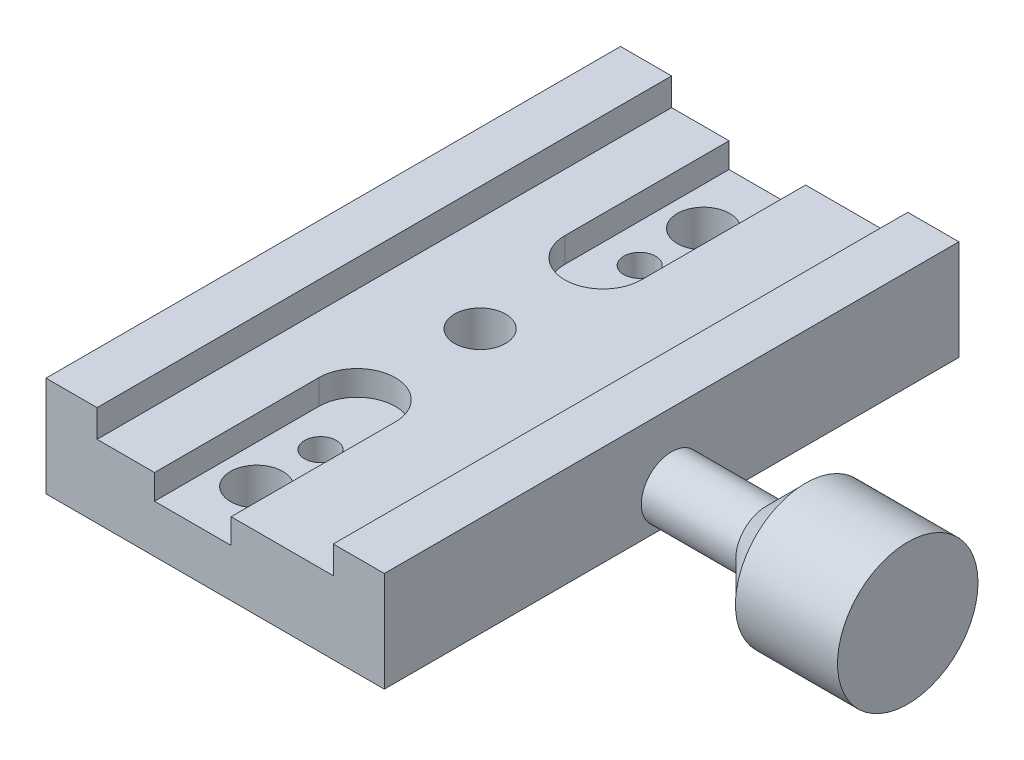
ISO-10303-21;
HEADER;
FILE_DESCRIPTION(('STEP AP214'),'2;1');
FILE_NAME('part.step','',(''),(''),'','','');
FILE_SCHEMA(('AUTOMOTIVE_DESIGN { 1 0 10303 214 1 1 1 1 }'));
ENDSEC;
DATA;
#1=APPLICATION_CONTEXT('core data for automotive mechanical design processes');
#2=APPLICATION_PROTOCOL_DEFINITION('international standard','automotive_design',2000,#1);
#3=PRODUCT_CONTEXT('',#1,'mechanical');
#4=PRODUCT('Part','Part','',(#3));
#5=PRODUCT_RELATED_PRODUCT_CATEGORY('part','',(#4));
#6=PRODUCT_DEFINITION_FORMATION('','',#4);
#7=PRODUCT_DEFINITION_CONTEXT('part definition',#1,'design');
#8=PRODUCT_DEFINITION('design','',#6,#7);
#9=PRODUCT_DEFINITION_SHAPE('','',#8);
#10=(LENGTH_UNIT() NAMED_UNIT(*) SI_UNIT(.MILLI.,.METRE.));
#11=(NAMED_UNIT(*) PLANE_ANGLE_UNIT() SI_UNIT($,.RADIAN.));
#12=(NAMED_UNIT(*) SI_UNIT($,.STERADIAN.) SOLID_ANGLE_UNIT());
#13=UNCERTAINTY_MEASURE_WITH_UNIT(LENGTH_MEASURE(1.E-05),#10,'distance_accuracy_value','');
#14=(GEOMETRIC_REPRESENTATION_CONTEXT(3) GLOBAL_UNCERTAINTY_ASSIGNED_CONTEXT((#13)) GLOBAL_UNIT_ASSIGNED_CONTEXT((#10,
#11,#12)) REPRESENTATION_CONTEXT('',''));
#15=CARTESIAN_POINT('',(0.,0.,0.));
#16=DIRECTION('',(0.,0.,1.));
#17=DIRECTION('',(1.,0.,0.));
#18=AXIS2_PLACEMENT_3D('',#15,#16,#17);
#19=CARTESIAN_POINT('',(0.,15.9715288495916,20.));
#20=DIRECTION('',(0.,-1.,0.));
#21=DIRECTION('',(0.,0.,-1.));
#22=AXIS2_PLACEMENT_3D('',#19,#20,#21);
#23=CYLINDRICAL_SURFACE('',#22,2.5);
#24=CARTESIAN_POINT('',(0.,0.,20.));
#25=DIRECTION('',(0.,1.,0.));
#26=DIRECTION('',(0.,0.,1.));
#27=AXIS2_PLACEMENT_3D('',#24,#25,#26);
#28=CIRCLE('',#27,2.5);
#29=CARTESIAN_POINT('',(0.,0.,22.5));
#30=VERTEX_POINT('',#29);
#31=EDGE_CURVE('E227',#30,#30,#28,.T.);
#32=ORIENTED_EDGE('',*,*,#31,.F.);
#33=EDGE_LOOP('',(#32));
#34=FACE_BOUND('',#33,.T.);
#35=CARTESIAN_POINT('',(0.,7.5,20.));
#36=DIRECTION('',(0.,1.,0.));
#37=DIRECTION('',(0.,0.,1.));
#38=AXIS2_PLACEMENT_3D('',#35,#36,#37);
#39=CIRCLE('',#38,2.5);
#40=CARTESIAN_POINT('',(0.,7.5,22.5));
#41=VERTEX_POINT('',#40);
#42=EDGE_CURVE('E220',#41,#41,#39,.T.);
#43=ORIENTED_EDGE('',*,*,#42,.T.);
#44=EDGE_LOOP('',(#43));
#45=FACE_BOUND('',#44,.T.);
#46=ADVANCED_FACE('F46',(#34,#45),#23,.F.);
#47=CARTESIAN_POINT('',(0.,15.9715288495916,9.99999999999999));
#48=DIRECTION('',(0.,-1.,0.));
#49=DIRECTION('',(0.,0.,-1.));
#50=AXIS2_PLACEMENT_3D('',#47,#48,#49);
#51=CYLINDRICAL_SURFACE('',#50,4.1);
#52=CARTESIAN_POINT('',(0.,0.,9.99999999999999));
#53=DIRECTION('',(0.,1.,0.));
#54=DIRECTION('',(0.,0.,1.));
#55=AXIS2_PLACEMENT_3D('',#52,#53,#54);
#56=CIRCLE('',#55,4.1);
#57=CARTESIAN_POINT('',(0.,0.,14.1));
#58=VERTEX_POINT('',#57);
#59=EDGE_CURVE('E231',#58,#58,#56,.T.);
#60=ORIENTED_EDGE('',*,*,#59,.F.);
#61=EDGE_LOOP('',(#60));
#62=FACE_BOUND('',#61,.T.);
#63=CARTESIAN_POINT('',(0.,7.5,9.99999999999999));
#64=DIRECTION('',(0.,1.,0.));
#65=DIRECTION('',(0.,0.,1.));
#66=AXIS2_PLACEMENT_3D('',#63,#64,#65);
#67=CIRCLE('',#66,4.1);
#68=CARTESIAN_POINT('',(0.,7.5,14.1));
#69=VERTEX_POINT('',#68);
#70=EDGE_CURVE('E219',#69,#69,#67,.T.);
#71=ORIENTED_EDGE('',*,*,#70,.T.);
#72=EDGE_LOOP('',(#71));
#73=FACE_BOUND('',#72,.T.);
#74=ADVANCED_FACE('F405',(#62,#73),#51,.F.);
#75=CARTESIAN_POINT('',(0.,15.9715288495916,70.));
#76=DIRECTION('',(0.,-1.,0.));
#77=DIRECTION('',(0.,0.,-1.));
#78=AXIS2_PLACEMENT_3D('',#75,#76,#77);
#79=CYLINDRICAL_SURFACE('',#78,2.5);
#80=CARTESIAN_POINT('',(0.,0.,70.));
#81=DIRECTION('',(0.,1.,0.));
#82=DIRECTION('',(0.,0.,-1.));
#83=AXIS2_PLACEMENT_3D('',#80,#81,#82);
#84=CIRCLE('',#83,2.5);
#85=CARTESIAN_POINT('',(0.,0.,67.5));
#86=VERTEX_POINT('',#85);
#87=EDGE_CURVE('E234',#86,#86,#84,.T.);
#88=ORIENTED_EDGE('',*,*,#87,.F.);
#89=EDGE_LOOP('',(#88));
#90=FACE_BOUND('',#89,.T.);
#91=CARTESIAN_POINT('',(0.,7.5,70.));
#92=DIRECTION('',(0.,1.,0.));
#93=DIRECTION('',(0.,0.,1.));
#94=AXIS2_PLACEMENT_3D('',#91,#92,#93);
#95=CIRCLE('',#94,2.5);
#96=CARTESIAN_POINT('',(0.,7.5,72.5));
#97=VERTEX_POINT('',#96);
#98=EDGE_CURVE('E214',#97,#97,#95,.T.);
#99=ORIENTED_EDGE('',*,*,#98,.T.);
#100=EDGE_LOOP('',(#99));
#101=FACE_BOUND('',#100,.T.);
#102=ADVANCED_FACE('F412',(#90,#101),#79,.F.);
#103=CARTESIAN_POINT('',(0.,15.9715288495916,80.));
#104=DIRECTION('',(0.,-1.,0.));
#105=DIRECTION('',(0.,0.,-1.));
#106=AXIS2_PLACEMENT_3D('',#103,#104,#105);
#107=CYLINDRICAL_SURFACE('',#106,4.1);
#108=CARTESIAN_POINT('',(0.,0.,80.));
#109=DIRECTION('',(0.,1.,0.));
#110=DIRECTION('',(0.,0.,-1.));
#111=AXIS2_PLACEMENT_3D('',#108,#109,#110);
#112=CIRCLE('',#111,4.1);
#113=CARTESIAN_POINT('',(0.,0.,75.9));
#114=VERTEX_POINT('',#113);
#115=EDGE_CURVE('E226',#114,#114,#112,.T.);
#116=ORIENTED_EDGE('',*,*,#115,.F.);
#117=EDGE_LOOP('',(#116));
#118=FACE_BOUND('',#117,.T.);
#119=CARTESIAN_POINT('',(0.,7.5,80.));
#120=DIRECTION('',(0.,1.,0.));
#121=DIRECTION('',(0.,0.,1.));
#122=AXIS2_PLACEMENT_3D('',#119,#120,#121);
#123=CIRCLE('',#122,4.1);
#124=CARTESIAN_POINT('',(0.,7.5,84.1));
#125=VERTEX_POINT('',#124);
#126=EDGE_CURVE('E190',#125,#125,#123,.T.);
#127=ORIENTED_EDGE('',*,*,#126,.T.);
#128=EDGE_LOOP('',(#127));
#129=FACE_BOUND('',#128,.T.);
#130=ADVANCED_FACE('F420',(#118,#129),#107,.F.);
#131=CARTESIAN_POINT('',(147.435028842544,4.97152884959158,45.));
#132=DIRECTION('',(-1.,0.,0.));
#133=DIRECTION('',(0.,0.,1.));
#134=AXIS2_PLACEMENT_3D('',#131,#132,#133);
#135=CYLINDRICAL_SURFACE('',#134,4.75);
#136=CARTESIAN_POINT('',(44.8000000000002,4.97152884959158,45.));
#137=DIRECTION('',(1.,0.,0.));
#138=DIRECTION('',(0.,0.,-1.));
#139=AXIS2_PLACEMENT_3D('',#136,#137,#138);
#140=CIRCLE('',#139,4.75);
#141=CARTESIAN_POINT('',(44.8000000000002,4.97152884959158,40.25));
#142=VERTEX_POINT('',#141);
#143=EDGE_CURVE('E322',#142,#142,#140,.F.);
#144=ORIENTED_EDGE('',*,*,#143,.T.);
#145=EDGE_LOOP('',(#144));
#146=FACE_BOUND('',#145,.T.);
#147=CARTESIAN_POINT('',(30.,4.97152884959158,45.));
#148=DIRECTION('',(-1.,0.,0.));
#149=DIRECTION('',(0.,0.,1.));
#150=AXIS2_PLACEMENT_3D('',#147,#148,#149);
#151=CIRCLE('',#150,4.75);
#152=CARTESIAN_POINT('',(30.,4.97152884959158,49.75));
#153=VERTEX_POINT('',#152);
#154=EDGE_CURVE('E316',#153,#153,#151,.F.);
#155=ORIENTED_EDGE('',*,*,#154,.T.);
#156=EDGE_LOOP('',(#155));
#157=FACE_BOUND('',#156,.T.);
#158=ADVANCED_FACE('F424',(#146,#157),#135,.T.);
#159=CARTESIAN_POINT('',(0.,0.,90.));
#160=DIRECTION('',(0.,1.,0.));
#161=DIRECTION('',(0.,0.,1.));
#162=AXIS2_PLACEMENT_3D('',#159,#160,#161);
#163=PLANE('',#162);
#164=ORIENTED_EDGE('',*,*,#115,.T.);
#165=EDGE_LOOP('',(#164));
#166=FACE_BOUND('',#165,.T.);
#167=ORIENTED_EDGE('',*,*,#87,.T.);
#168=EDGE_LOOP('',(#167));
#169=FACE_BOUND('',#168,.T.);
#170=ORIENTED_EDGE('',*,*,#59,.T.);
#171=EDGE_LOOP('',(#170));
#172=FACE_BOUND('',#171,.T.);
#173=ORIENTED_EDGE('',*,*,#31,.T.);
#174=EDGE_LOOP('',(#173));
#175=FACE_BOUND('',#174,.T.);
#176=CARTESIAN_POINT('',(0.,0.,45.));
#177=DIRECTION('',(0.,1.,0.));
#178=DIRECTION('',(0.,0.,1.));
#179=AXIS2_PLACEMENT_3D('',#176,#177,#178);
#180=CIRCLE('',#179,4.);
#181=CARTESIAN_POINT('',(0.,0.,49.));
#182=VERTEX_POINT('',#181);
#183=EDGE_CURVE('E230',#182,#182,#180,.T.);
#184=ORIENTED_EDGE('',*,*,#183,.T.);
#185=EDGE_LOOP('',(#184));
#186=FACE_BOUND('',#185,.T.);
#187=DIRECTION('',(1.,0.,0.));
#188=VECTOR('',#187,1.);
#189=CARTESIAN_POINT('',(0.,0.,0.));
#190=LINE('',#189,#188);
#191=CARTESIAN_POINT('',(-23.,0.,0.));
#192=VERTEX_POINT('',#191);
#193=CARTESIAN_POINT('',(30.,0.,0.));
#194=VERTEX_POINT('',#193);
#195=EDGE_CURVE('E245',#192,#194,#190,.T.);
#196=ORIENTED_EDGE('',*,*,#195,.T.);
#197=DIRECTION('',(0.,0.,-1.));
#198=VECTOR('',#197,1.);
#199=CARTESIAN_POINT('',(30.,0.,90.));
#200=LINE('',#199,#198);
#201=CARTESIAN_POINT('',(30.,0.,90.));
#202=VERTEX_POINT('',#201);
#203=EDGE_CURVE('E312',#202,#194,#200,.T.);
#204=ORIENTED_EDGE('',*,*,#203,.F.);
#205=DIRECTION('',(1.,0.,0.));
#206=VECTOR('',#205,1.);
#207=CARTESIAN_POINT('',(0.,0.,90.));
#208=LINE('',#207,#206);
#209=CARTESIAN_POINT('',(-23.,0.,90.));
#210=VERTEX_POINT('',#209);
#211=EDGE_CURVE('E249',#210,#202,#208,.T.);
#212=ORIENTED_EDGE('',*,*,#211,.F.);
#213=DIRECTION('',(0.,0.,-1.));
#214=VECTOR('',#213,1.);
#215=CARTESIAN_POINT('',(-23.,0.,90.));
#216=LINE('',#215,#214);
#217=EDGE_CURVE('E268',#210,#192,#216,.T.);
#218=ORIENTED_EDGE('',*,*,#217,.T.);
#219=EDGE_LOOP('',(#196,#204,#212,#218));
#220=FACE_BOUND('',#219,.T.);
#221=ADVANCED_FACE('F364',(#166,#169,#172,#175,#186,#220),#163,.F.);
#222=CARTESIAN_POINT('',(30.,0.,90.));
#223=DIRECTION('',(-1.,0.,0.));
#224=DIRECTION('',(0.,0.,1.));
#225=AXIS2_PLACEMENT_3D('',#222,#223,#224);
#226=PLANE('',#225);
#227=ORIENTED_EDGE('',*,*,#154,.F.);
#228=EDGE_LOOP('',(#227));
#229=FACE_BOUND('',#228,.T.);
#230=DIRECTION('',(0.,1.,0.));
#231=VECTOR('',#230,1.);
#232=CARTESIAN_POINT('',(30.,0.,0.));
#233=LINE('',#232,#231);
#234=CARTESIAN_POINT('',(30.,15.7,0.));
#235=VERTEX_POINT('',#234);
#236=EDGE_CURVE('E270',#194,#235,#233,.T.);
#237=ORIENTED_EDGE('',*,*,#236,.T.);
#238=DIRECTION('',(0.,0.,-1.));
#239=VECTOR('',#238,1.);
#240=CARTESIAN_POINT('',(30.,15.7,90.));
#241=LINE('',#240,#239);
#242=CARTESIAN_POINT('',(30.,15.7,90.));
#243=VERTEX_POINT('',#242);
#244=EDGE_CURVE('E308',#243,#235,#241,.T.);
#245=ORIENTED_EDGE('',*,*,#244,.F.);
#246=DIRECTION('',(0.,1.,0.));
#247=VECTOR('',#246,1.);
#248=CARTESIAN_POINT('',(30.,0.,90.));
#249=LINE('',#248,#247);
#250=EDGE_CURVE('E251',#202,#243,#249,.T.);
#251=ORIENTED_EDGE('',*,*,#250,.F.);
#252=ORIENTED_EDGE('',*,*,#203,.T.);
#253=EDGE_LOOP('',(#237,#245,#251,#252));
#254=FACE_BOUND('',#253,.T.);
#255=ADVANCED_FACE('F370',(#229,#254),#226,.F.);
#256=CARTESIAN_POINT('',(30.,15.7,90.));
#257=DIRECTION('',(0.,-1.,0.));
#258=DIRECTION('',(0.,0.,-1.));
#259=AXIS2_PLACEMENT_3D('',#256,#257,#258);
#260=PLANE('',#259);
#261=DIRECTION('',(-1.,0.,0.));
#262=VECTOR('',#261,1.);
#263=CARTESIAN_POINT('',(30.,15.7,0.));
#264=LINE('',#263,#262);
#265=CARTESIAN_POINT('',(22.,15.7,0.));
#266=VERTEX_POINT('',#265);
#267=EDGE_CURVE('E272',#235,#266,#264,.T.);
#268=ORIENTED_EDGE('',*,*,#267,.T.);
#269=DIRECTION('',(0.,0.,-1.));
#270=VECTOR('',#269,1.);
#271=CARTESIAN_POINT('',(22.,15.7,90.));
#272=LINE('',#271,#270);
#273=CARTESIAN_POINT('',(22.,15.7,90.));
#274=VERTEX_POINT('',#273);
#275=EDGE_CURVE('E304',#274,#266,#272,.T.);
#276=ORIENTED_EDGE('',*,*,#275,.F.);
#277=DIRECTION('',(-1.,0.,0.));
#278=VECTOR('',#277,1.);
#279=CARTESIAN_POINT('',(30.,15.7,90.));
#280=LINE('',#279,#278);
#281=EDGE_CURVE('E254',#243,#274,#280,.T.);
#282=ORIENTED_EDGE('',*,*,#281,.F.);
#283=ORIENTED_EDGE('',*,*,#244,.T.);
#284=EDGE_LOOP('',(#268,#276,#282,#283));
#285=FACE_BOUND('',#284,.T.);
#286=ADVANCED_FACE('F374',(#285),#260,.F.);
#287=CARTESIAN_POINT('',(22.,15.7,90.));
#288=DIRECTION('',(1.,0.,0.));
#289=DIRECTION('',(0.,0.,-1.));
#290=AXIS2_PLACEMENT_3D('',#287,#288,#289);
#291=PLANE('',#290);
#292=DIRECTION('',(0.,-1.,0.));
#293=VECTOR('',#292,1.);
#294=CARTESIAN_POINT('',(22.,15.7,0.));
#295=LINE('',#294,#293);
#296=CARTESIAN_POINT('',(22.,11.4,0.));
#297=VERTEX_POINT('',#296);
#298=EDGE_CURVE('E274',#266,#297,#295,.T.);
#299=ORIENTED_EDGE('',*,*,#298,.T.);
#300=DIRECTION('',(0.,0.,-1.));
#301=VECTOR('',#300,1.);
#302=CARTESIAN_POINT('',(22.,11.4,90.));
#303=LINE('',#302,#301);
#304=CARTESIAN_POINT('',(22.,11.4,90.));
#305=VERTEX_POINT('',#304);
#306=EDGE_CURVE('E301',#305,#297,#303,.T.);
#307=ORIENTED_EDGE('',*,*,#306,.F.);
#308=DIRECTION('',(0.,-1.,0.));
#309=VECTOR('',#308,1.);
#310=CARTESIAN_POINT('',(22.,15.7,90.));
#311=LINE('',#310,#309);
#312=EDGE_CURVE('E256',#274,#305,#311,.T.);
#313=ORIENTED_EDGE('',*,*,#312,.F.);
#314=ORIENTED_EDGE('',*,*,#275,.T.);
#315=EDGE_LOOP('',(#299,#307,#313,#314));
#316=FACE_BOUND('',#315,.T.);
#317=ADVANCED_FACE('F379',(#316),#291,.F.);
#318=CARTESIAN_POINT('',(-15.,11.4,90.));
#319=DIRECTION('',(0.,-1.,0.));
#320=DIRECTION('',(1.,0.,0.));
#321=AXIS2_PLACEMENT_3D('',#318,#319,#320);
#322=PLANE('',#321);
#323=CARTESIAN_POINT('',(0.,11.4,45.));
#324=DIRECTION('',(0.,-1.,0.));
#325=DIRECTION('',(1.,0.,0.));
#326=AXIS2_PLACEMENT_3D('',#323,#324,#325);
#327=CIRCLE('',#326,4.);
#328=CARTESIAN_POINT('',(4.00000000000001,11.4,45.));
#329=VERTEX_POINT('',#328);
#330=EDGE_CURVE('E241',#329,#329,#327,.F.);
#331=ORIENTED_EDGE('',*,*,#330,.F.);
#332=EDGE_LOOP('',(#331));
#333=FACE_BOUND('',#332,.T.);
#334=CARTESIAN_POINT('',(0.,11.4,25.7294246898479));
#335=DIRECTION('',(0.,1.,0.));
#336=DIRECTION('',(-1.,0.,0.));
#337=AXIS2_PLACEMENT_3D('',#334,#335,#336);
#338=CIRCLE('',#337,6.);
#339=CARTESIAN_POINT('',(-6.,11.4,25.7294246898479));
#340=VERTEX_POINT('',#339);
#341=CARTESIAN_POINT('',(6.,11.4,25.7294246898479));
#342=VERTEX_POINT('',#341);
#343=EDGE_CURVE('E171',#340,#342,#338,.T.);
#344=ORIENTED_EDGE('',*,*,#343,.F.);
#345=DIRECTION('',(0.,0.,1.));
#346=VECTOR('',#345,1.);
#347=CARTESIAN_POINT('',(-6.,11.4,25.7294246898479));
#348=LINE('',#347,#346);
#349=CARTESIAN_POINT('',(-6.,11.4,0.));
#350=VERTEX_POINT('',#349);
#351=EDGE_CURVE('E167',#350,#340,#348,.T.);
#352=ORIENTED_EDGE('',*,*,#351,.F.);
#353=DIRECTION('',(-1.,0.,0.));
#354=VECTOR('',#353,1.);
#355=CARTESIAN_POINT('',(-15.,11.4,0.));
#356=LINE('',#355,#354);
#357=CARTESIAN_POINT('',(-15.,11.4,0.));
#358=VERTEX_POINT('',#357);
#359=EDGE_CURVE('E277',#350,#358,#356,.T.);
#360=ORIENTED_EDGE('',*,*,#359,.T.);
#361=DIRECTION('',(0.,0.,-1.));
#362=VECTOR('',#361,1.);
#363=CARTESIAN_POINT('',(-15.,11.4,90.));
#364=LINE('',#363,#362);
#365=CARTESIAN_POINT('',(-15.,11.4,90.));
#366=VERTEX_POINT('',#365);
#367=EDGE_CURVE('E297',#366,#358,#364,.T.);
#368=ORIENTED_EDGE('',*,*,#367,.F.);
#369=DIRECTION('',(-1.,0.,0.));
#370=VECTOR('',#369,1.);
#371=CARTESIAN_POINT('',(22.,11.4,90.));
#372=LINE('',#371,#370);
#373=CARTESIAN_POINT('',(-6.,11.4,90.));
#374=VERTEX_POINT('',#373);
#375=EDGE_CURVE('E258',#374,#366,#372,.T.);
#376=ORIENTED_EDGE('',*,*,#375,.F.);
#377=DIRECTION('',(0.,0.,1.));
#378=VECTOR('',#377,1.);
#379=CARTESIAN_POINT('',(-6.,11.4,64.2705753101521));
#380=LINE('',#379,#378);
#381=CARTESIAN_POINT('',(-6.,11.4,64.2705753101521));
#382=VERTEX_POINT('',#381);
#383=EDGE_CURVE('E204',#382,#374,#380,.T.);
#384=ORIENTED_EDGE('',*,*,#383,.F.);
#385=CARTESIAN_POINT('',(0.,11.4,64.2705753101521));
#386=DIRECTION('',(0.,1.,0.));
#387=DIRECTION('',(1.,0.,0.));
#388=AXIS2_PLACEMENT_3D('',#385,#386,#387);
#389=CIRCLE('',#388,6.);
#390=CARTESIAN_POINT('',(6.,11.4,64.2705753101521));
#391=VERTEX_POINT('',#390);
#392=EDGE_CURVE('E176',#391,#382,#389,.T.);
#393=ORIENTED_EDGE('',*,*,#392,.F.);
#394=DIRECTION('',(0.,0.,-1.));
#395=VECTOR('',#394,1.);
#396=CARTESIAN_POINT('',(6.,11.4,64.2705753101521));
#397=LINE('',#396,#395);
#398=CARTESIAN_POINT('',(6.,11.4,90.));
#399=VERTEX_POINT('',#398);
#400=EDGE_CURVE('E197',#399,#391,#397,.T.);
#401=ORIENTED_EDGE('',*,*,#400,.F.);
#402=EDGE_CURVE('E259',#305,#399,#372,.T.);
#403=ORIENTED_EDGE('',*,*,#402,.F.);
#404=ORIENTED_EDGE('',*,*,#306,.T.);
#405=CARTESIAN_POINT('',(6.,11.4,0.));
#406=VERTEX_POINT('',#405);
#407=EDGE_CURVE('E181',#297,#406,#356,.T.);
#408=ORIENTED_EDGE('',*,*,#407,.T.);
#409=DIRECTION('',(0.,0.,-1.));
#410=VECTOR('',#409,1.);
#411=CARTESIAN_POINT('',(6.,11.4,25.7294246898479));
#412=LINE('',#411,#410);
#413=EDGE_CURVE('E163',#342,#406,#412,.T.);
#414=ORIENTED_EDGE('',*,*,#413,.F.);
#415=EDGE_LOOP('',(#344,#352,#360,#368,#376,#384,#393,#401,#403,#404,#408,#414));
#416=FACE_BOUND('',#415,.T.);
#417=ADVANCED_FACE('F179',(#333,#416),#322,.F.);
#418=CARTESIAN_POINT('',(-15.,15.7,90.));
#419=DIRECTION('',(-1.,0.,0.));
#420=DIRECTION('',(0.,-1.,0.));
#421=AXIS2_PLACEMENT_3D('',#418,#419,#420);
#422=PLANE('',#421);
#423=DIRECTION('',(0.,1.,0.));
#424=VECTOR('',#423,1.);
#425=CARTESIAN_POINT('',(-15.,15.7,0.));
#426=LINE('',#425,#424);
#427=CARTESIAN_POINT('',(-15.,15.7,0.));
#428=VERTEX_POINT('',#427);
#429=EDGE_CURVE('E280',#358,#428,#426,.T.);
#430=ORIENTED_EDGE('',*,*,#429,.T.);
#431=DIRECTION('',(0.,0.,-1.));
#432=VECTOR('',#431,1.);
#433=CARTESIAN_POINT('',(-15.,15.7,90.));
#434=LINE('',#433,#432);
#435=CARTESIAN_POINT('',(-15.,15.7,90.));
#436=VERTEX_POINT('',#435);
#437=EDGE_CURVE('E293',#436,#428,#434,.T.);
#438=ORIENTED_EDGE('',*,*,#437,.F.);
#439=DIRECTION('',(0.,1.,0.));
#440=VECTOR('',#439,1.);
#441=CARTESIAN_POINT('',(-15.,15.7,90.));
#442=LINE('',#441,#440);
#443=EDGE_CURVE('E262',#366,#436,#442,.T.);
#444=ORIENTED_EDGE('',*,*,#443,.F.);
#445=ORIENTED_EDGE('',*,*,#367,.T.);
#446=EDGE_LOOP('',(#430,#438,#444,#445));
#447=FACE_BOUND('',#446,.T.);
#448=ADVANCED_FACE('F350',(#447),#422,.F.);
#449=CARTESIAN_POINT('',(-23.,15.7,90.));
#450=DIRECTION('',(0.,-1.,0.));
#451=DIRECTION('',(0.,0.,-1.));
#452=AXIS2_PLACEMENT_3D('',#449,#450,#451);
#453=PLANE('',#452);
#454=DIRECTION('',(-1.,0.,0.));
#455=VECTOR('',#454,1.);
#456=CARTESIAN_POINT('',(-23.,15.7,0.));
#457=LINE('',#456,#455);
#458=CARTESIAN_POINT('',(-23.,15.7,0.));
#459=VERTEX_POINT('',#458);
#460=EDGE_CURVE('E282',#428,#459,#457,.T.);
#461=ORIENTED_EDGE('',*,*,#460,.T.);
#462=DIRECTION('',(0.,0.,-1.));
#463=VECTOR('',#462,1.);
#464=CARTESIAN_POINT('',(-23.,15.7,90.));
#465=LINE('',#464,#463);
#466=CARTESIAN_POINT('',(-23.,15.7,90.));
#467=VERTEX_POINT('',#466);
#468=EDGE_CURVE('E289',#467,#459,#465,.T.);
#469=ORIENTED_EDGE('',*,*,#468,.F.);
#470=DIRECTION('',(-1.,0.,0.));
#471=VECTOR('',#470,1.);
#472=CARTESIAN_POINT('',(-23.,15.7,90.));
#473=LINE('',#472,#471);
#474=EDGE_CURVE('E264',#436,#467,#473,.T.);
#475=ORIENTED_EDGE('',*,*,#474,.F.);
#476=ORIENTED_EDGE('',*,*,#437,.T.);
#477=EDGE_LOOP('',(#461,#469,#475,#476));
#478=FACE_BOUND('',#477,.T.);
#479=ADVANCED_FACE('F356',(#478),#453,.F.);
#480=CARTESIAN_POINT('',(-23.,0.,90.));
#481=DIRECTION('',(1.,0.,0.));
#482=DIRECTION('',(0.,0.,-1.));
#483=AXIS2_PLACEMENT_3D('',#480,#481,#482);
#484=PLANE('',#483);
#485=DIRECTION('',(0.,-1.,0.));
#486=VECTOR('',#485,1.);
#487=CARTESIAN_POINT('',(-23.,0.,0.));
#488=LINE('',#487,#486);
#489=EDGE_CURVE('E252',#459,#192,#488,.T.);
#490=ORIENTED_EDGE('',*,*,#489,.T.);
#491=ORIENTED_EDGE('',*,*,#217,.F.);
#492=DIRECTION('',(0.,-1.,0.));
#493=VECTOR('',#492,1.);
#494=CARTESIAN_POINT('',(-23.,0.,90.));
#495=LINE('',#494,#493);
#496=EDGE_CURVE('E266',#467,#210,#495,.T.);
#497=ORIENTED_EDGE('',*,*,#496,.F.);
#498=ORIENTED_EDGE('',*,*,#468,.T.);
#499=EDGE_LOOP('',(#490,#491,#497,#498));
#500=FACE_BOUND('',#499,.T.);
#501=ADVANCED_FACE('F360',(#500),#484,.F.);
#502=CARTESIAN_POINT('',(0.,0.,90.));
#503=DIRECTION('',(0.,0.,-1.));
#504=DIRECTION('',(-1.,0.,0.));
#505=AXIS2_PLACEMENT_3D('',#502,#503,#504);
#506=PLANE('',#505);
#507=ORIENTED_EDGE('',*,*,#402,.T.);
#508=DIRECTION('',(0.,-1.,0.));
#509=VECTOR('',#508,1.);
#510=CARTESIAN_POINT('',(6.,0.,90.));
#511=LINE('',#510,#509);
#512=CARTESIAN_POINT('',(6.,7.5,90.));
#513=VERTEX_POINT('',#512);
#514=EDGE_CURVE('E13',#399,#513,#511,.T.);
#515=ORIENTED_EDGE('',*,*,#514,.T.);
#516=DIRECTION('',(1.,0.,0.));
#517=VECTOR('',#516,1.);
#518=CARTESIAN_POINT('',(0.,7.5,90.));
#519=LINE('',#518,#517);
#520=CARTESIAN_POINT('',(-6.,7.5,90.));
#521=VERTEX_POINT('',#520);
#522=EDGE_CURVE('E217',#521,#513,#519,.T.);
#523=ORIENTED_EDGE('',*,*,#522,.F.);
#524=DIRECTION('',(0.,1.,0.));
#525=VECTOR('',#524,1.);
#526=CARTESIAN_POINT('',(-6.,0.,90.));
#527=LINE('',#526,#525);
#528=EDGE_CURVE('E55',#521,#374,#527,.T.);
#529=ORIENTED_EDGE('',*,*,#528,.T.);
#530=ORIENTED_EDGE('',*,*,#375,.T.);
#531=ORIENTED_EDGE('',*,*,#443,.T.);
#532=ORIENTED_EDGE('',*,*,#474,.T.);
#533=ORIENTED_EDGE('',*,*,#496,.T.);
#534=ORIENTED_EDGE('',*,*,#211,.T.);
#535=ORIENTED_EDGE('',*,*,#250,.T.);
#536=ORIENTED_EDGE('',*,*,#281,.T.);
#537=ORIENTED_EDGE('',*,*,#312,.T.);
#538=EDGE_LOOP('',(#507,#515,#523,#529,#530,#531,#532,#533,#534,#535,#536,#537));
#539=FACE_BOUND('',#538,.T.);
#540=ADVANCED_FACE('F340',(#539),#506,.F.);
#541=CARTESIAN_POINT('',(0.,0.,0.));
#542=DIRECTION('',(0.,0.,-1.));
#543=DIRECTION('',(-1.,0.,0.));
#544=AXIS2_PLACEMENT_3D('',#541,#542,#543);
#545=PLANE('',#544);
#546=DIRECTION('',(0.,1.,0.));
#547=VECTOR('',#546,1.);
#548=CARTESIAN_POINT('',(-6.,0.,0.));
#549=LINE('',#548,#547);
#550=CARTESIAN_POINT('',(-6.,7.5,0.));
#551=VERTEX_POINT('',#550);
#552=EDGE_CURVE('E335',#551,#350,#549,.T.);
#553=ORIENTED_EDGE('',*,*,#552,.F.);
#554=DIRECTION('',(1.,0.,0.));
#555=VECTOR('',#554,1.);
#556=CARTESIAN_POINT('',(0.,7.5,0.));
#557=LINE('',#556,#555);
#558=CARTESIAN_POINT('',(6.,7.5,0.));
#559=VERTEX_POINT('',#558);
#560=EDGE_CURVE('E223',#551,#559,#557,.T.);
#561=ORIENTED_EDGE('',*,*,#560,.T.);
#562=DIRECTION('',(0.,-1.,0.));
#563=VECTOR('',#562,1.);
#564=CARTESIAN_POINT('',(6.,0.,0.));
#565=LINE('',#564,#563);
#566=EDGE_CURVE('E325',#406,#559,#565,.T.);
#567=ORIENTED_EDGE('',*,*,#566,.F.);
#568=ORIENTED_EDGE('',*,*,#407,.F.);
#569=ORIENTED_EDGE('',*,*,#298,.F.);
#570=ORIENTED_EDGE('',*,*,#267,.F.);
#571=ORIENTED_EDGE('',*,*,#236,.F.);
#572=ORIENTED_EDGE('',*,*,#195,.F.);
#573=ORIENTED_EDGE('',*,*,#489,.F.);
#574=ORIENTED_EDGE('',*,*,#460,.F.);
#575=ORIENTED_EDGE('',*,*,#429,.F.);
#576=ORIENTED_EDGE('',*,*,#359,.F.);
#577=EDGE_LOOP('',(#553,#561,#567,#568,#569,#570,#571,#572,#573,#574,#575,#576));
#578=FACE_BOUND('',#577,.T.);
#579=ADVANCED_FACE('F437',(#578),#545,.T.);
#580=CARTESIAN_POINT('',(51.,4.97152884959158,45.));
#581=DIRECTION('',(1.,0.,0.));
#582=DIRECTION('',(0.,0.,-1.));
#583=AXIS2_PLACEMENT_3D('',#580,#581,#582);
#584=CYLINDRICAL_SURFACE('',#583,11.);
#585=CARTESIAN_POINT('',(51.,4.97152884959158,45.));
#586=DIRECTION('',(1.,0.,0.));
#587=DIRECTION('',(0.,0.,-1.));
#588=AXIS2_PLACEMENT_3D('',#585,#586,#587);
#589=CIRCLE('',#588,11.);
#590=CARTESIAN_POINT('',(51.,4.97152884959158,34.));
#591=VERTEX_POINT('',#590);
#592=EDGE_CURVE('E242',#591,#591,#589,.T.);
#593=ORIENTED_EDGE('',*,*,#592,.T.);
#594=EDGE_LOOP('',(#593));
#595=FACE_BOUND('',#594,.T.);
#596=CARTESIAN_POINT('',(67.,4.97152884959158,45.));
#597=DIRECTION('',(1.,0.,0.));
#598=DIRECTION('',(0.,0.,-1.));
#599=AXIS2_PLACEMENT_3D('',#596,#597,#598);
#600=CIRCLE('',#599,11.);
#601=CARTESIAN_POINT('',(67.,4.97152884959158,34.));
#602=VERTEX_POINT('',#601);
#603=EDGE_CURVE('E246',#602,#602,#600,.T.);
#604=ORIENTED_EDGE('',*,*,#603,.F.);
#605=EDGE_LOOP('',(#604));
#606=FACE_BOUND('',#605,.T.);
#607=ADVANCED_FACE('F434',(#595,#606),#584,.T.);
#608=CARTESIAN_POINT('',(51.,4.97152884959158,45.));
#609=DIRECTION('',(1.,0.,0.));
#610=DIRECTION('',(0.,0.,-1.));
#611=AXIS2_PLACEMENT_3D('',#608,#609,#610);
#612=PLANE('',#611);
#613=CARTESIAN_POINT('',(51.,4.97152884959158,45.));
#614=DIRECTION('',(1.,0.,0.));
#615=DIRECTION('',(0.,0.,-1.));
#616=AXIS2_PLACEMENT_3D('',#613,#614,#615);
#617=CIRCLE('',#616,10.9499999999999);
#618=CARTESIAN_POINT('',(51.,4.97152884959158,34.0500000000001));
#619=VERTEX_POINT('',#618);
#620=EDGE_CURVE('E319',#619,#619,#617,.T.);
#621=ORIENTED_EDGE('',*,*,#620,.T.);
#622=EDGE_LOOP('',(#621));
#623=FACE_BOUND('',#622,.T.);
#624=ORIENTED_EDGE('',*,*,#592,.F.);
#625=EDGE_LOOP('',(#624));
#626=FACE_BOUND('',#625,.T.);
#627=ADVANCED_FACE('F430',(#623,#626),#612,.F.);
#628=CARTESIAN_POINT('',(67.,0.,0.));
#629=DIRECTION('',(1.,0.,0.));
#630=DIRECTION('',(0.,0.,-1.));
#631=AXIS2_PLACEMENT_3D('',#628,#629,#630);
#632=PLANE('',#631);
#633=ORIENTED_EDGE('',*,*,#603,.T.);
#634=EDGE_LOOP('',(#633));
#635=FACE_BOUND('',#634,.T.);
#636=ADVANCED_FACE('F433',(#635),#632,.T.);
#637=CARTESIAN_POINT('',(51.,4.97152884959158,45.));
#638=DIRECTION('',(1.,0.,0.));
#639=DIRECTION('',(0.,0.,-1.));
#640=AXIS2_PLACEMENT_3D('',#637,#638,#639);
#641=CONICAL_SURFACE('',#640,10.9499999999999,0.785398163397458);
#642=ORIENTED_EDGE('',*,*,#143,.F.);
#643=EDGE_LOOP('',(#642));
#644=FACE_BOUND('',#643,.T.);
#645=ORIENTED_EDGE('',*,*,#620,.F.);
#646=EDGE_LOOP('',(#645));
#647=FACE_BOUND('',#646,.T.);
#648=ADVANCED_FACE('F49',(#644,#647),#641,.T.);
#649=CARTESIAN_POINT('',(0.,15.9715288495916,45.));
#650=DIRECTION('',(0.,-1.,0.));
#651=DIRECTION('',(0.,0.,-1.));
#652=AXIS2_PLACEMENT_3D('',#649,#650,#651);
#653=CYLINDRICAL_SURFACE('',#652,4.);
#654=ORIENTED_EDGE('',*,*,#183,.F.);
#655=EDGE_LOOP('',(#654));
#656=FACE_BOUND('',#655,.T.);
#657=ORIENTED_EDGE('',*,*,#330,.T.);
#658=EDGE_LOOP('',(#657));
#659=FACE_BOUND('',#658,.T.);
#660=ADVANCED_FACE('F426',(#656,#659),#653,.F.);
#661=CARTESIAN_POINT('',(6.00000000000001,-47.2639430946947,64.2705753101521));
#662=DIRECTION('',(1.,0.,0.));
#663=DIRECTION('',(0.,1.,0.));
#664=AXIS2_PLACEMENT_3D('',#661,#662,#663);
#665=PLANE('',#664);
#666=ORIENTED_EDGE('',*,*,#400,.T.);
#667=DIRECTION('',(0.,1.,0.));
#668=VECTOR('',#667,1.);
#669=CARTESIAN_POINT('',(6.00000000000001,-47.2639430946947,64.2705753101521));
#670=LINE('',#669,#668);
#671=CARTESIAN_POINT('',(6.,7.5,64.2705753101521));
#672=VERTEX_POINT('',#671);
#673=EDGE_CURVE('E198',#672,#391,#670,.T.);
#674=ORIENTED_EDGE('',*,*,#673,.F.);
#675=DIRECTION('',(0.,0.,1.));
#676=VECTOR('',#675,1.);
#677=CARTESIAN_POINT('',(6.,7.5,64.2705753101521));
#678=LINE('',#677,#676);
#679=EDGE_CURVE('E201',#672,#513,#678,.T.);
#680=ORIENTED_EDGE('',*,*,#679,.T.);
#681=ORIENTED_EDGE('',*,*,#514,.F.);
#682=EDGE_LOOP('',(#666,#674,#680,#681));
#683=FACE_BOUND('',#682,.T.);
#684=ADVANCED_FACE('F384',(#683),#665,.F.);
#685=CARTESIAN_POINT('',(-5.99999999999999,-47.2639430946947,64.2705753101521));
#686=DIRECTION('',(-1.,0.,0.));
#687=DIRECTION('',(0.,-1.,0.));
#688=AXIS2_PLACEMENT_3D('',#685,#686,#687);
#689=PLANE('',#688);
#690=DIRECTION('',(0.,0.,-1.));
#691=VECTOR('',#690,1.);
#692=CARTESIAN_POINT('',(-6.,7.5,64.2705753101521));
#693=LINE('',#692,#691);
#694=CARTESIAN_POINT('',(-6.,7.5,64.2705753101521));
#695=VERTEX_POINT('',#694);
#696=EDGE_CURVE('E62',#521,#695,#693,.T.);
#697=ORIENTED_EDGE('',*,*,#696,.T.);
#698=DIRECTION('',(0.,1.,0.));
#699=VECTOR('',#698,1.);
#700=CARTESIAN_POINT('',(-5.99999999999999,-47.2639430946947,64.2705753101521));
#701=LINE('',#700,#699);
#702=EDGE_CURVE('E195',#695,#382,#701,.T.);
#703=ORIENTED_EDGE('',*,*,#702,.T.);
#704=ORIENTED_EDGE('',*,*,#383,.T.);
#705=ORIENTED_EDGE('',*,*,#528,.F.);
#706=EDGE_LOOP('',(#697,#703,#704,#705));
#707=FACE_BOUND('',#706,.T.);
#708=ADVANCED_FACE('F391',(#707),#689,.F.);
#709=CARTESIAN_POINT('',(0.,7.5,90.));
#710=DIRECTION('',(0.,1.,0.));
#711=DIRECTION('',(0.,0.,1.));
#712=AXIS2_PLACEMENT_3D('',#709,#710,#711);
#713=PLANE('',#712);
#714=ORIENTED_EDGE('',*,*,#126,.F.);
#715=EDGE_LOOP('',(#714));
#716=FACE_BOUND('',#715,.T.);
#717=ORIENTED_EDGE('',*,*,#98,.F.);
#718=EDGE_LOOP('',(#717));
#719=FACE_BOUND('',#718,.T.);
#720=ORIENTED_EDGE('',*,*,#522,.T.);
#721=ORIENTED_EDGE('',*,*,#679,.F.);
#722=CARTESIAN_POINT('',(0.,7.5,64.2705753101521));
#723=DIRECTION('',(0.,1.,0.));
#724=DIRECTION('',(0.,0.,1.));
#725=AXIS2_PLACEMENT_3D('',#722,#723,#724);
#726=CIRCLE('',#725,6.);
#727=EDGE_CURVE('E194',#695,#672,#726,.F.);
#728=ORIENTED_EDGE('',*,*,#727,.F.);
#729=ORIENTED_EDGE('',*,*,#696,.F.);
#730=EDGE_LOOP('',(#720,#721,#728,#729));
#731=FACE_BOUND('',#730,.T.);
#732=ADVANCED_FACE('F389',(#716,#719,#731),#713,.T.);
#733=CARTESIAN_POINT('',(0.,-47.2639430946947,64.2705753101521));
#734=DIRECTION('',(0.,1.,0.));
#735=DIRECTION('',(-1.,0.,0.));
#736=AXIS2_PLACEMENT_3D('',#733,#734,#735);
#737=CYLINDRICAL_SURFACE('',#736,6.);
#738=ORIENTED_EDGE('',*,*,#727,.T.);
#739=ORIENTED_EDGE('',*,*,#673,.T.);
#740=ORIENTED_EDGE('',*,*,#392,.T.);
#741=ORIENTED_EDGE('',*,*,#702,.F.);
#742=EDGE_LOOP('',(#738,#739,#740,#741));
#743=FACE_BOUND('',#742,.T.);
#744=ADVANCED_FACE('F386',(#743),#737,.F.);
#745=CARTESIAN_POINT('',(0.,-47.2639430946947,25.7294246898479));
#746=DIRECTION('',(0.,1.,0.));
#747=DIRECTION('',(-1.,0.,0.));
#748=AXIS2_PLACEMENT_3D('',#745,#746,#747);
#749=CYLINDRICAL_SURFACE('',#748,6.);
#750=CARTESIAN_POINT('',(0.,7.5,25.7294246898479));
#751=DIRECTION('',(0.,1.,0.));
#752=DIRECTION('',(0.,0.,1.));
#753=AXIS2_PLACEMENT_3D('',#750,#751,#752);
#754=CIRCLE('',#753,6.);
#755=CARTESIAN_POINT('',(6.,7.5,25.7294246898479));
#756=VERTEX_POINT('',#755);
#757=CARTESIAN_POINT('',(-6.,7.5,25.7294246898479));
#758=VERTEX_POINT('',#757);
#759=EDGE_CURVE('E191',#756,#758,#754,.F.);
#760=ORIENTED_EDGE('',*,*,#759,.T.);
#761=DIRECTION('',(0.,1.,0.));
#762=VECTOR('',#761,1.);
#763=CARTESIAN_POINT('',(-5.99999999999999,-47.2639430946947,25.7294246898479));
#764=LINE('',#763,#762);
#765=EDGE_CURVE('E166',#758,#340,#764,.T.);
#766=ORIENTED_EDGE('',*,*,#765,.T.);
#767=ORIENTED_EDGE('',*,*,#343,.T.);
#768=DIRECTION('',(0.,1.,0.));
#769=VECTOR('',#768,1.);
#770=CARTESIAN_POINT('',(6.00000000000001,-47.2639430946947,25.7294246898479));
#771=LINE('',#770,#769);
#772=EDGE_CURVE('E159',#756,#342,#771,.T.);
#773=ORIENTED_EDGE('',*,*,#772,.F.);
#774=EDGE_LOOP('',(#760,#766,#767,#773));
#775=FACE_BOUND('',#774,.T.);
#776=ADVANCED_FACE('F172',(#775),#749,.F.);
#777=CARTESIAN_POINT('',(-5.99999999999999,-47.2639430946947,25.7294246898479));
#778=DIRECTION('',(-1.,0.,0.));
#779=DIRECTION('',(0.,-1.,0.));
#780=AXIS2_PLACEMENT_3D('',#777,#778,#779);
#781=PLANE('',#780);
#782=ORIENTED_EDGE('',*,*,#552,.T.);
#783=ORIENTED_EDGE('',*,*,#351,.T.);
#784=ORIENTED_EDGE('',*,*,#765,.F.);
#785=DIRECTION('',(0.,0.,-1.));
#786=VECTOR('',#785,1.);
#787=CARTESIAN_POINT('',(-6.,7.5,25.7294246898479));
#788=LINE('',#787,#786);
#789=EDGE_CURVE('E187',#758,#551,#788,.T.);
#790=ORIENTED_EDGE('',*,*,#789,.T.);
#791=EDGE_LOOP('',(#782,#783,#784,#790));
#792=FACE_BOUND('',#791,.T.);
#793=ADVANCED_FACE('F490',(#792),#781,.F.);
#794=CARTESIAN_POINT('',(6.00000000000001,-47.2639430946947,25.7294246898479));
#795=DIRECTION('',(1.,0.,0.));
#796=DIRECTION('',(0.,1.,0.));
#797=AXIS2_PLACEMENT_3D('',#794,#795,#796);
#798=PLANE('',#797);
#799=ORIENTED_EDGE('',*,*,#566,.T.);
#800=DIRECTION('',(0.,0.,1.));
#801=VECTOR('',#800,1.);
#802=CARTESIAN_POINT('',(6.,7.5,25.7294246898479));
#803=LINE('',#802,#801);
#804=EDGE_CURVE('E70',#559,#756,#803,.T.);
#805=ORIENTED_EDGE('',*,*,#804,.T.);
#806=ORIENTED_EDGE('',*,*,#772,.T.);
#807=ORIENTED_EDGE('',*,*,#413,.T.);
#808=EDGE_LOOP('',(#799,#805,#806,#807));
#809=FACE_BOUND('',#808,.T.);
#810=ADVANCED_FACE('F161',(#809),#798,.F.);
#811=CARTESIAN_POINT('',(0.,7.5,90.));
#812=DIRECTION('',(0.,1.,0.));
#813=DIRECTION('',(0.,0.,1.));
#814=AXIS2_PLACEMENT_3D('',#811,#812,#813);
#815=PLANE('',#814);
#816=ORIENTED_EDGE('',*,*,#42,.F.);
#817=EDGE_LOOP('',(#816));
#818=FACE_BOUND('',#817,.T.);
#819=ORIENTED_EDGE('',*,*,#70,.F.);
#820=EDGE_LOOP('',(#819));
#821=FACE_BOUND('',#820,.T.);
#822=ORIENTED_EDGE('',*,*,#789,.F.);
#823=ORIENTED_EDGE('',*,*,#759,.F.);
#824=ORIENTED_EDGE('',*,*,#804,.F.);
#825=ORIENTED_EDGE('',*,*,#560,.F.);
#826=EDGE_LOOP('',(#822,#823,#824,#825));
#827=FACE_BOUND('',#826,.T.);
#828=ADVANCED_FACE('F481',(#818,#821,#827),#815,.T.);
#829=CLOSED_SHELL('',(#46,#74,#102,#130,#158,#221,#255,#286,#317,#417,#448,#479,#501,#540,#579,
#607,#627,#636,#648,#660,#684,#708,#732,#744,#776,#793,#810,#828));
#830=MANIFOLD_SOLID_BREP('B2',#829);
#831=ADVANCED_BREP_SHAPE_REPRESENTATION('',(#18,#830),#14);
#832=SHAPE_DEFINITION_REPRESENTATION(#9,#831);
ENDSEC;
END-ISO-10303-21;
